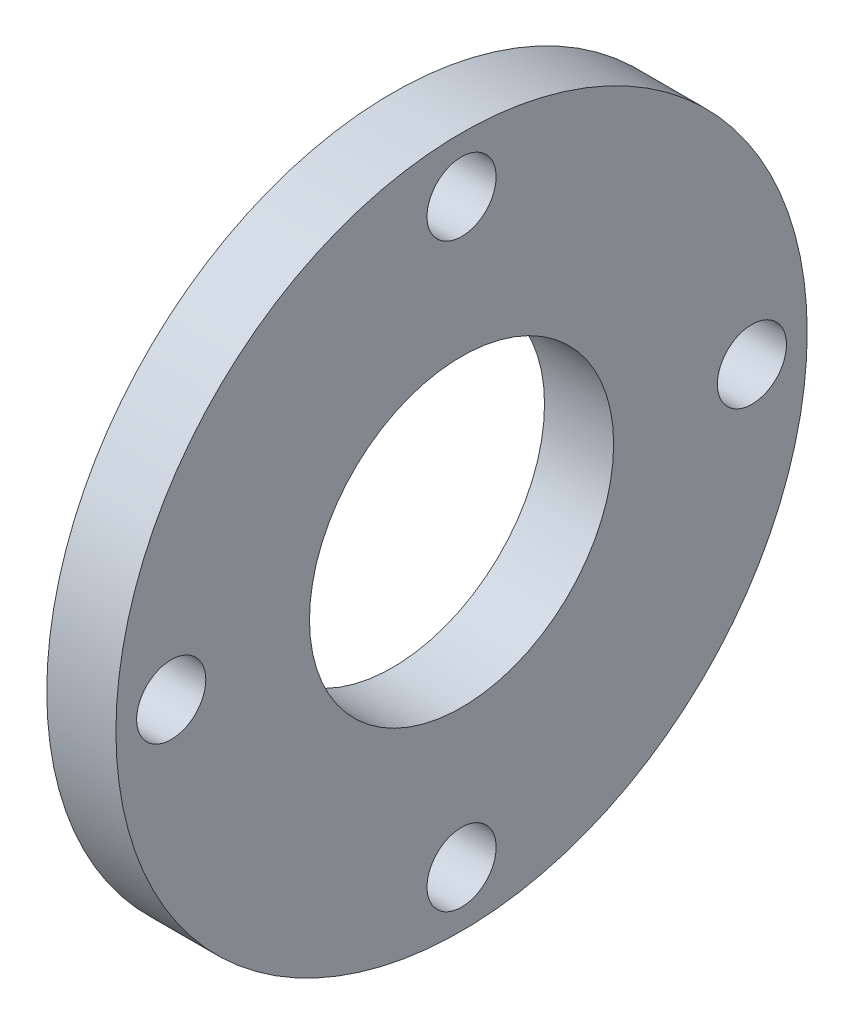
ISO-10303-21;
HEADER;
FILE_DESCRIPTION(('STEP AP214'),'2;1');
FILE_NAME('part.step','',(''),(''),'','','');
FILE_SCHEMA(('AUTOMOTIVE_DESIGN { 1 0 10303 214 1 1 1 1 }'));
ENDSEC;
DATA;
#1=APPLICATION_CONTEXT('core data for automotive mechanical design processes');
#2=APPLICATION_PROTOCOL_DEFINITION('international standard','automotive_design',2000,#1);
#3=PRODUCT_CONTEXT('',#1,'mechanical');
#4=PRODUCT('Part','Part','',(#3));
#5=PRODUCT_RELATED_PRODUCT_CATEGORY('part','',(#4));
#6=PRODUCT_DEFINITION_FORMATION('','',#4);
#7=PRODUCT_DEFINITION_CONTEXT('part definition',#1,'design');
#8=PRODUCT_DEFINITION('design','',#6,#7);
#9=PRODUCT_DEFINITION_SHAPE('','',#8);
#10=(LENGTH_UNIT() NAMED_UNIT(*) SI_UNIT(.MILLI.,.METRE.));
#11=(NAMED_UNIT(*) PLANE_ANGLE_UNIT() SI_UNIT($,.RADIAN.));
#12=(NAMED_UNIT(*) SI_UNIT($,.STERADIAN.) SOLID_ANGLE_UNIT());
#13=UNCERTAINTY_MEASURE_WITH_UNIT(LENGTH_MEASURE(1.E-05),#10,'distance_accuracy_value','');
#14=(GEOMETRIC_REPRESENTATION_CONTEXT(3) GLOBAL_UNCERTAINTY_ASSIGNED_CONTEXT((#13)) GLOBAL_UNIT_ASSIGNED_CONTEXT((#10,
#11,#12)) REPRESENTATION_CONTEXT('',''));
#15=CARTESIAN_POINT('',(0.,0.,0.));
#16=DIRECTION('',(0.,0.,1.));
#17=DIRECTION('',(1.,0.,0.));
#18=AXIS2_PLACEMENT_3D('',#15,#16,#17);
#19=CARTESIAN_POINT('',(5.,0.,0.));
#20=DIRECTION('',(1.,0.,0.));
#21=DIRECTION('',(0.,0.,-1.));
#22=AXIS2_PLACEMENT_3D('',#19,#20,#21);
#23=PLANE('',#22);
#24=CARTESIAN_POINT('',(5.,4.24856065297083E-13,-21.0000000000004));
#25=DIRECTION('',(1.,0.,0.));
#26=DIRECTION('',(0.,0.,-1.));
#27=AXIS2_PLACEMENT_3D('',#24,#25,#26);
#28=CIRCLE('',#27,2.5);
#29=CARTESIAN_POINT('',(5.,4.24856065297083E-13,-23.5000000000004));
#30=VERTEX_POINT('',#29);
#31=EDGE_CURVE('E56',#30,#30,#28,.T.);
#32=ORIENTED_EDGE('',*,*,#31,.F.);
#33=EDGE_LOOP('',(#32));
#34=FACE_BOUND('',#33,.T.);
#35=CARTESIAN_POINT('',(5.,-21.,-8.49712130594167E-13));
#36=DIRECTION('',(1.,0.,0.));
#37=DIRECTION('',(0.,0.,-1.));
#38=AXIS2_PLACEMENT_3D('',#35,#36,#37);
#39=CIRCLE('',#38,2.5);
#40=CARTESIAN_POINT('',(5.,-21.,-2.50000000000085));
#41=VERTEX_POINT('',#40);
#42=EDGE_CURVE('E101',#41,#41,#39,.T.);
#43=ORIENTED_EDGE('',*,*,#42,.F.);
#44=EDGE_LOOP('',(#43));
#45=FACE_BOUND('',#44,.T.);
#46=CARTESIAN_POINT('',(5.,-4.27427823575293E-13,20.9999999999996));
#47=DIRECTION('',(1.,0.,0.));
#48=DIRECTION('',(0.,0.,-1.));
#49=AXIS2_PLACEMENT_3D('',#46,#47,#48);
#50=CIRCLE('',#49,2.5);
#51=CARTESIAN_POINT('',(5.,-4.27427823575293E-13,18.4999999999996));
#52=VERTEX_POINT('',#51);
#53=EDGE_CURVE('E68',#52,#52,#50,.T.);
#54=ORIENTED_EDGE('',*,*,#53,.F.);
#55=EDGE_LOOP('',(#54));
#56=FACE_BOUND('',#55,.T.);
#57=CARTESIAN_POINT('',(5.,21.,0.));
#58=DIRECTION('',(1.,0.,0.));
#59=DIRECTION('',(0.,0.,-1.));
#60=AXIS2_PLACEMENT_3D('',#57,#58,#59);
#61=CIRCLE('',#60,2.5);
#62=CARTESIAN_POINT('',(5.,21.,-2.5));
#63=VERTEX_POINT('',#62);
#64=EDGE_CURVE('E52',#63,#63,#61,.T.);
#65=ORIENTED_EDGE('',*,*,#64,.F.);
#66=EDGE_LOOP('',(#65));
#67=FACE_BOUND('',#66,.T.);
#68=CARTESIAN_POINT('',(5.,0.,0.));
#69=DIRECTION('',(1.,0.,0.));
#70=DIRECTION('',(0.,0.,-1.));
#71=AXIS2_PLACEMENT_3D('',#68,#69,#70);
#72=CIRCLE('',#71,25.);
#73=CARTESIAN_POINT('',(5.,0.,-25.));
#74=VERTEX_POINT('',#73);
#75=EDGE_CURVE('E10',#74,#74,#72,.T.);
#76=ORIENTED_EDGE('',*,*,#75,.T.);
#77=EDGE_LOOP('',(#76));
#78=FACE_BOUND('',#77,.T.);
#79=CARTESIAN_POINT('',(5.,0.,0.));
#80=DIRECTION('',(1.,0.,0.));
#81=DIRECTION('',(0.,0.,-1.));
#82=AXIS2_PLACEMENT_3D('',#79,#80,#81);
#83=CIRCLE('',#82,11.);
#84=CARTESIAN_POINT('',(5.,0.,-11.));
#85=VERTEX_POINT('',#84);
#86=EDGE_CURVE('E43',#85,#85,#83,.T.);
#87=ORIENTED_EDGE('',*,*,#86,.F.);
#88=EDGE_LOOP('',(#87));
#89=FACE_BOUND('',#88,.T.);
#90=ADVANCED_FACE('F30',(#34,#45,#56,#67,#78,#89),#23,.T.);
#91=CARTESIAN_POINT('',(0.,0.,0.));
#92=DIRECTION('',(1.,0.,0.));
#93=DIRECTION('',(0.,0.,-1.));
#94=AXIS2_PLACEMENT_3D('',#91,#92,#93);
#95=PLANE('',#94);
#96=CARTESIAN_POINT('',(0.,4.24856065297083E-13,-21.0000000000004));
#97=DIRECTION('',(1.,0.,0.));
#98=DIRECTION('',(0.,0.,-1.));
#99=AXIS2_PLACEMENT_3D('',#96,#97,#98);
#100=CIRCLE('',#99,2.5);
#101=CARTESIAN_POINT('',(0.,4.24856065297083E-13,-23.5000000000004));
#102=VERTEX_POINT('',#101);
#103=EDGE_CURVE('E34',#102,#102,#100,.T.);
#104=ORIENTED_EDGE('',*,*,#103,.T.);
#105=EDGE_LOOP('',(#104));
#106=FACE_BOUND('',#105,.T.);
#107=CARTESIAN_POINT('',(0.,-21.,-8.49712130594167E-13));
#108=DIRECTION('',(1.,0.,0.));
#109=DIRECTION('',(0.,0.,-1.));
#110=AXIS2_PLACEMENT_3D('',#107,#108,#109);
#111=CIRCLE('',#110,2.5);
#112=CARTESIAN_POINT('',(0.,-21.,-2.50000000000085));
#113=VERTEX_POINT('',#112);
#114=EDGE_CURVE('E55',#113,#113,#111,.T.);
#115=ORIENTED_EDGE('',*,*,#114,.T.);
#116=EDGE_LOOP('',(#115));
#117=FACE_BOUND('',#116,.T.);
#118=CARTESIAN_POINT('',(0.,-4.27427823575293E-13,20.9999999999996));
#119=DIRECTION('',(1.,0.,0.));
#120=DIRECTION('',(0.,0.,-1.));
#121=AXIS2_PLACEMENT_3D('',#118,#119,#120);
#122=CIRCLE('',#121,2.5);
#123=CARTESIAN_POINT('',(0.,-4.27427823575293E-13,18.4999999999996));
#124=VERTEX_POINT('',#123);
#125=EDGE_CURVE('E53',#124,#124,#122,.T.);
#126=ORIENTED_EDGE('',*,*,#125,.T.);
#127=EDGE_LOOP('',(#126));
#128=FACE_BOUND('',#127,.T.);
#129=CARTESIAN_POINT('',(0.,21.,0.));
#130=DIRECTION('',(1.,0.,0.));
#131=DIRECTION('',(0.,0.,-1.));
#132=AXIS2_PLACEMENT_3D('',#129,#130,#131);
#133=CIRCLE('',#132,2.5);
#134=CARTESIAN_POINT('',(0.,21.,-2.5));
#135=VERTEX_POINT('',#134);
#136=EDGE_CURVE('E49',#135,#135,#133,.T.);
#137=ORIENTED_EDGE('',*,*,#136,.T.);
#138=EDGE_LOOP('',(#137));
#139=FACE_BOUND('',#138,.T.);
#140=CARTESIAN_POINT('',(0.,0.,0.));
#141=DIRECTION('',(1.,0.,0.));
#142=DIRECTION('',(0.,0.,-1.));
#143=AXIS2_PLACEMENT_3D('',#140,#141,#142);
#144=CIRCLE('',#143,25.);
#145=CARTESIAN_POINT('',(0.,0.,-25.));
#146=VERTEX_POINT('',#145);
#147=EDGE_CURVE('E38',#146,#146,#144,.T.);
#148=ORIENTED_EDGE('',*,*,#147,.F.);
#149=EDGE_LOOP('',(#148));
#150=FACE_BOUND('',#149,.T.);
#151=CARTESIAN_POINT('',(0.,0.,0.));
#152=DIRECTION('',(1.,0.,0.));
#153=DIRECTION('',(0.,0.,-1.));
#154=AXIS2_PLACEMENT_3D('',#151,#152,#153);
#155=CIRCLE('',#154,11.);
#156=CARTESIAN_POINT('',(0.,0.,-11.));
#157=VERTEX_POINT('',#156);
#158=EDGE_CURVE('E46',#157,#157,#155,.T.);
#159=ORIENTED_EDGE('',*,*,#158,.T.);
#160=EDGE_LOOP('',(#159));
#161=FACE_BOUND('',#160,.T.);
#162=ADVANCED_FACE('F76',(#106,#117,#128,#139,#150,#161),#95,.F.);
#163=CARTESIAN_POINT('',(5.,0.,0.));
#164=DIRECTION('',(-1.,0.,0.));
#165=DIRECTION('',(0.,0.,1.));
#166=AXIS2_PLACEMENT_3D('',#163,#164,#165);
#167=CYLINDRICAL_SURFACE('',#166,25.);
#168=ORIENTED_EDGE('',*,*,#75,.F.);
#169=EDGE_LOOP('',(#168));
#170=FACE_BOUND('',#169,.T.);
#171=ORIENTED_EDGE('',*,*,#147,.T.);
#172=EDGE_LOOP('',(#171));
#173=FACE_BOUND('',#172,.T.);
#174=ADVANCED_FACE('F32',(#170,#173),#167,.T.);
#175=CARTESIAN_POINT('',(5.,0.,0.));
#176=DIRECTION('',(-1.,0.,0.));
#177=DIRECTION('',(0.,0.,1.));
#178=AXIS2_PLACEMENT_3D('',#175,#176,#177);
#179=CYLINDRICAL_SURFACE('',#178,11.);
#180=ORIENTED_EDGE('',*,*,#86,.T.);
#181=EDGE_LOOP('',(#180));
#182=FACE_BOUND('',#181,.T.);
#183=ORIENTED_EDGE('',*,*,#158,.F.);
#184=EDGE_LOOP('',(#183));
#185=FACE_BOUND('',#184,.T.);
#186=ADVANCED_FACE('F78',(#182,#185),#179,.F.);
#187=CARTESIAN_POINT('',(-5.,21.,0.));
#188=DIRECTION('',(1.,0.,0.));
#189=DIRECTION('',(0.,0.,-1.));
#190=AXIS2_PLACEMENT_3D('',#187,#188,#189);
#191=CYLINDRICAL_SURFACE('',#190,2.5);
#192=ORIENTED_EDGE('',*,*,#64,.T.);
#193=EDGE_LOOP('',(#192));
#194=FACE_BOUND('',#193,.T.);
#195=ORIENTED_EDGE('',*,*,#136,.F.);
#196=EDGE_LOOP('',(#195));
#197=FACE_BOUND('',#196,.T.);
#198=ADVANCED_FACE('F80',(#194,#197),#191,.F.);
#199=CARTESIAN_POINT('',(-5.,-4.27427823575293E-13,20.9999999999996));
#200=DIRECTION('',(1.,0.,0.));
#201=DIRECTION('',(0.,0.,-1.));
#202=AXIS2_PLACEMENT_3D('',#199,#200,#201);
#203=CYLINDRICAL_SURFACE('',#202,2.5);
#204=ORIENTED_EDGE('',*,*,#53,.T.);
#205=EDGE_LOOP('',(#204));
#206=FACE_BOUND('',#205,.T.);
#207=ORIENTED_EDGE('',*,*,#125,.F.);
#208=EDGE_LOOP('',(#207));
#209=FACE_BOUND('',#208,.T.);
#210=ADVANCED_FACE('F86',(#206,#209),#203,.F.);
#211=CARTESIAN_POINT('',(-5.,-21.,-8.49712130594167E-13));
#212=DIRECTION('',(1.,0.,0.));
#213=DIRECTION('',(0.,0.,-1.));
#214=AXIS2_PLACEMENT_3D('',#211,#212,#213);
#215=CYLINDRICAL_SURFACE('',#214,2.5);
#216=ORIENTED_EDGE('',*,*,#42,.T.);
#217=EDGE_LOOP('',(#216));
#218=FACE_BOUND('',#217,.T.);
#219=ORIENTED_EDGE('',*,*,#114,.F.);
#220=EDGE_LOOP('',(#219));
#221=FACE_BOUND('',#220,.T.);
#222=ADVANCED_FACE('F113',(#218,#221),#215,.F.);
#223=CARTESIAN_POINT('',(-5.,4.24856065297083E-13,-21.0000000000004));
#224=DIRECTION('',(1.,0.,0.));
#225=DIRECTION('',(0.,0.,-1.));
#226=AXIS2_PLACEMENT_3D('',#223,#224,#225);
#227=CYLINDRICAL_SURFACE('',#226,2.5);
#228=ORIENTED_EDGE('',*,*,#31,.T.);
#229=EDGE_LOOP('',(#228));
#230=FACE_BOUND('',#229,.T.);
#231=ORIENTED_EDGE('',*,*,#103,.F.);
#232=EDGE_LOOP('',(#231));
#233=FACE_BOUND('',#232,.T.);
#234=ADVANCED_FACE('F110',(#230,#233),#227,.F.);
#235=CLOSED_SHELL('',(#90,#162,#174,#186,#198,#210,#222,#234));
#236=MANIFOLD_SOLID_BREP('B2',#235);
#237=ADVANCED_BREP_SHAPE_REPRESENTATION('',(#18,#236),#14);
#238=SHAPE_DEFINITION_REPRESENTATION(#9,#237);
ENDSEC;
END-ISO-10303-21;
